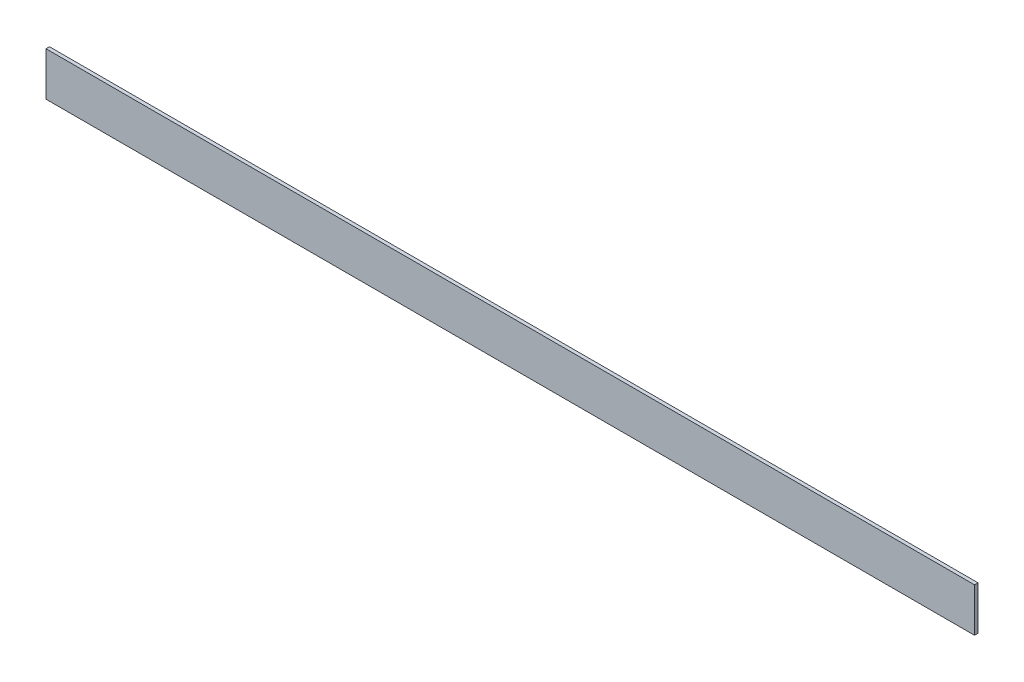
ISO-10303-21;
HEADER;
FILE_DESCRIPTION(('STEP AP214'),'2;1');
FILE_NAME('part.step','',(''),(''),'','','');
FILE_SCHEMA(('AUTOMOTIVE_DESIGN { 1 0 10303 214 1 1 1 1 }'));
ENDSEC;
DATA;
#1=APPLICATION_CONTEXT('core data for automotive mechanical design processes');
#2=APPLICATION_PROTOCOL_DEFINITION('international standard','automotive_design',2000,#1);
#3=PRODUCT_CONTEXT('',#1,'mechanical');
#4=PRODUCT('Part','Part','',(#3));
#5=PRODUCT_RELATED_PRODUCT_CATEGORY('part','',(#4));
#6=PRODUCT_DEFINITION_FORMATION('','',#4);
#7=PRODUCT_DEFINITION_CONTEXT('part definition',#1,'design');
#8=PRODUCT_DEFINITION('design','',#6,#7);
#9=PRODUCT_DEFINITION_SHAPE('','',#8);
#10=(LENGTH_UNIT() NAMED_UNIT(*) SI_UNIT(.MILLI.,.METRE.));
#11=(NAMED_UNIT(*) PLANE_ANGLE_UNIT() SI_UNIT($,.RADIAN.));
#12=(NAMED_UNIT(*) SI_UNIT($,.STERADIAN.) SOLID_ANGLE_UNIT());
#13=UNCERTAINTY_MEASURE_WITH_UNIT(LENGTH_MEASURE(1.E-05),#10,'distance_accuracy_value','');
#14=(GEOMETRIC_REPRESENTATION_CONTEXT(3) GLOBAL_UNCERTAINTY_ASSIGNED_CONTEXT((#13)) GLOBAL_UNIT_ASSIGNED_CONTEXT((#10,
#11,#12)) REPRESENTATION_CONTEXT('',''));
#15=CARTESIAN_POINT('',(0.,0.,0.));
#16=DIRECTION('',(0.,0.,1.));
#17=DIRECTION('',(1.,0.,0.));
#18=AXIS2_PLACEMENT_3D('',#15,#16,#17);
#19=CARTESIAN_POINT('',(531.,0.,0.));
#20=DIRECTION('',(0.,1.,0.));
#21=DIRECTION('',(0.,0.,1.));
#22=AXIS2_PLACEMENT_3D('',#19,#20,#21);
#23=PLANE('',#22);
#24=DIRECTION('',(0.,0.,-1.));
#25=VECTOR('',#24,1.);
#26=CARTESIAN_POINT('',(508.,0.,-2.));
#27=LINE('',#26,#25);
#28=CARTESIAN_POINT('',(508.,0.,-2.));
#29=VERTEX_POINT('',#28);
#30=CARTESIAN_POINT('',(508.,0.,-25.));
#31=VERTEX_POINT('',#30);
#32=EDGE_CURVE('E113',#29,#31,#27,.T.);
#33=ORIENTED_EDGE('',*,*,#32,.F.);
#34=DIRECTION('',(-1.,0.,0.));
#35=VECTOR('',#34,1.);
#36=CARTESIAN_POINT('',(531.,0.,-2.));
#37=LINE('',#36,#35);
#38=CARTESIAN_POINT('',(531.,0.,-2.));
#39=VERTEX_POINT('',#38);
#40=EDGE_CURVE('E121',#39,#29,#37,.T.);
#41=ORIENTED_EDGE('',*,*,#40,.F.);
#42=DIRECTION('',(0.,0.,-1.));
#43=VECTOR('',#42,1.);
#44=CARTESIAN_POINT('',(531.,0.,0.));
#45=LINE('',#44,#43);
#46=CARTESIAN_POINT('',(531.,0.,0.));
#47=VERTEX_POINT('',#46);
#48=EDGE_CURVE('E147',#47,#39,#45,.T.);
#49=ORIENTED_EDGE('',*,*,#48,.F.);
#50=DIRECTION('',(-1.,0.,0.));
#51=VECTOR('',#50,1.);
#52=CARTESIAN_POINT('',(531.,0.,0.));
#53=LINE('',#52,#51);
#54=CARTESIAN_POINT('',(0.,0.,0.));
#55=VERTEX_POINT('',#54);
#56=EDGE_CURVE('E154',#47,#55,#53,.T.);
#57=ORIENTED_EDGE('',*,*,#56,.T.);
#58=DIRECTION('',(0.,0.,-1.));
#59=VECTOR('',#58,1.);
#60=CARTESIAN_POINT('',(0.,0.,0.));
#61=LINE('',#60,#59);
#62=CARTESIAN_POINT('',(0.,0.,-2.));
#63=VERTEX_POINT('',#62);
#64=EDGE_CURVE('E146',#55,#63,#61,.T.);
#65=ORIENTED_EDGE('',*,*,#64,.T.);
#66=DIRECTION('',(-1.,0.,0.));
#67=VECTOR('',#66,1.);
#68=CARTESIAN_POINT('',(0.,0.,-2.));
#69=LINE('',#68,#67);
#70=CARTESIAN_POINT('',(23.,0.,-2.));
#71=VERTEX_POINT('',#70);
#72=EDGE_CURVE('E136',#71,#63,#69,.T.);
#73=ORIENTED_EDGE('',*,*,#72,.F.);
#74=DIRECTION('',(0.,0.,1.));
#75=VECTOR('',#74,1.);
#76=CARTESIAN_POINT('',(23.,0.,-2.));
#77=LINE('',#76,#75);
#78=CARTESIAN_POINT('',(23.,0.,-25.));
#79=VERTEX_POINT('',#78);
#80=EDGE_CURVE('E133',#79,#71,#77,.T.);
#81=ORIENTED_EDGE('',*,*,#80,.F.);
#82=DIRECTION('',(-1.,0.,0.));
#83=VECTOR('',#82,1.);
#84=CARTESIAN_POINT('',(531.,0.,-25.));
#85=LINE('',#84,#83);
#86=EDGE_CURVE('E11',#31,#79,#85,.T.);
#87=ORIENTED_EDGE('',*,*,#86,.F.);
#88=EDGE_LOOP('',(#33,#41,#49,#57,#65,#73,#81,#87));
#89=FACE_BOUND('',#88,.T.);
#90=ADVANCED_FACE('F36',(#89),#23,.F.);
#91=CARTESIAN_POINT('',(531.,2.,-25.));
#92=DIRECTION('',(0.,0.,-1.));
#93=DIRECTION('',(-1.,0.,0.));
#94=AXIS2_PLACEMENT_3D('',#91,#92,#93);
#95=PLANE('',#94);
#96=DIRECTION('',(0.,-1.,0.));
#97=VECTOR('',#96,1.);
#98=CARTESIAN_POINT('',(508.,25.,-25.));
#99=LINE('',#98,#97);
#100=CARTESIAN_POINT('',(508.,2.,-25.));
#101=VERTEX_POINT('',#100);
#102=EDGE_CURVE('E118',#101,#31,#99,.T.);
#103=ORIENTED_EDGE('',*,*,#102,.T.);
#104=ORIENTED_EDGE('',*,*,#86,.T.);
#105=DIRECTION('',(0.,-1.,0.));
#106=VECTOR('',#105,1.);
#107=CARTESIAN_POINT('',(23.,25.,-25.));
#108=LINE('',#107,#106);
#109=CARTESIAN_POINT('',(23.,2.,-25.));
#110=VERTEX_POINT('',#109);
#111=EDGE_CURVE('E138',#110,#79,#108,.T.);
#112=ORIENTED_EDGE('',*,*,#111,.F.);
#113=DIRECTION('',(-1.,0.,0.));
#114=VECTOR('',#113,1.);
#115=CARTESIAN_POINT('',(531.,2.,-25.));
#116=LINE('',#115,#114);
#117=EDGE_CURVE('E43',#101,#110,#116,.T.);
#118=ORIENTED_EDGE('',*,*,#117,.F.);
#119=EDGE_LOOP('',(#103,#104,#112,#118));
#120=FACE_BOUND('',#119,.T.);
#121=ADVANCED_FACE('F175',(#120),#95,.T.);
#122=CARTESIAN_POINT('',(531.,2.,0.));
#123=DIRECTION('',(0.,1.,0.));
#124=DIRECTION('',(0.,0.,1.));
#125=AXIS2_PLACEMENT_3D('',#122,#123,#124);
#126=PLANE('',#125);
#127=DIRECTION('',(0.,0.,1.));
#128=VECTOR('',#127,1.);
#129=CARTESIAN_POINT('',(508.,2.,0.));
#130=LINE('',#129,#128);
#131=CARTESIAN_POINT('',(508.,2.,-2.));
#132=VERTEX_POINT('',#131);
#133=EDGE_CURVE('E116',#101,#132,#130,.T.);
#134=ORIENTED_EDGE('',*,*,#133,.F.);
#135=ORIENTED_EDGE('',*,*,#117,.T.);
#136=DIRECTION('',(0.,0.,-1.));
#137=VECTOR('',#136,1.);
#138=CARTESIAN_POINT('',(23.,2.,0.));
#139=LINE('',#138,#137);
#140=CARTESIAN_POINT('',(23.,2.,-2.));
#141=VERTEX_POINT('',#140);
#142=EDGE_CURVE('E141',#141,#110,#139,.T.);
#143=ORIENTED_EDGE('',*,*,#142,.F.);
#144=DIRECTION('',(-1.,0.,0.));
#145=VECTOR('',#144,1.);
#146=CARTESIAN_POINT('',(531.,2.,-2.));
#147=LINE('',#146,#145);
#148=EDGE_CURVE('E165',#132,#141,#147,.T.);
#149=ORIENTED_EDGE('',*,*,#148,.F.);
#150=EDGE_LOOP('',(#134,#135,#143,#149));
#151=FACE_BOUND('',#150,.T.);
#152=ADVANCED_FACE('F169',(#151),#126,.T.);
#153=CARTESIAN_POINT('',(531.,25.,-2.));
#154=DIRECTION('',(0.,0.,-1.));
#155=DIRECTION('',(0.,1.,0.));
#156=AXIS2_PLACEMENT_3D('',#153,#154,#155);
#157=PLANE('',#156);
#158=DIRECTION('',(0.,-1.,0.));
#159=VECTOR('',#158,1.);
#160=CARTESIAN_POINT('',(0.,25.,-2.));
#161=LINE('',#160,#159);
#162=CARTESIAN_POINT('',(0.,25.,-2.));
#163=VERTEX_POINT('',#162);
#164=EDGE_CURVE('E50',#163,#63,#161,.T.);
#165=ORIENTED_EDGE('',*,*,#164,.F.);
#166=DIRECTION('',(-1.,0.,0.));
#167=VECTOR('',#166,1.);
#168=CARTESIAN_POINT('',(531.,25.,-2.));
#169=LINE('',#168,#167);
#170=CARTESIAN_POINT('',(531.,25.,-2.));
#171=VERTEX_POINT('',#170);
#172=EDGE_CURVE('E81',#171,#163,#169,.T.);
#173=ORIENTED_EDGE('',*,*,#172,.F.);
#174=DIRECTION('',(0.,-1.,0.));
#175=VECTOR('',#174,1.);
#176=CARTESIAN_POINT('',(531.,25.,-2.));
#177=LINE('',#176,#175);
#178=EDGE_CURVE('E123',#171,#39,#177,.T.);
#179=ORIENTED_EDGE('',*,*,#178,.T.);
#180=ORIENTED_EDGE('',*,*,#40,.T.);
#181=DIRECTION('',(0.,-1.,0.));
#182=VECTOR('',#181,1.);
#183=CARTESIAN_POINT('',(508.,25.,-2.));
#184=LINE('',#183,#182);
#185=EDGE_CURVE('E109',#132,#29,#184,.T.);
#186=ORIENTED_EDGE('',*,*,#185,.F.);
#187=ORIENTED_EDGE('',*,*,#148,.T.);
#188=DIRECTION('',(0.,-1.,0.));
#189=VECTOR('',#188,1.);
#190=CARTESIAN_POINT('',(23.,25.,-2.));
#191=LINE('',#190,#189);
#192=EDGE_CURVE('E139',#141,#71,#191,.T.);
#193=ORIENTED_EDGE('',*,*,#192,.T.);
#194=ORIENTED_EDGE('',*,*,#72,.T.);
#195=EDGE_LOOP('',(#165,#173,#179,#180,#186,#187,#193,#194));
#196=FACE_BOUND('',#195,.T.);
#197=ADVANCED_FACE('F122',(#196),#157,.T.);
#198=CARTESIAN_POINT('',(531.,25.,0.));
#199=DIRECTION('',(0.,1.,0.));
#200=DIRECTION('',(0.,0.,1.));
#201=AXIS2_PLACEMENT_3D('',#198,#199,#200);
#202=PLANE('',#201);
#203=DIRECTION('',(0.,0.,-1.));
#204=VECTOR('',#203,1.);
#205=CARTESIAN_POINT('',(0.,25.,0.));
#206=LINE('',#205,#204);
#207=CARTESIAN_POINT('',(0.,25.,0.));
#208=VERTEX_POINT('',#207);
#209=EDGE_CURVE('E158',#208,#163,#206,.T.);
#210=ORIENTED_EDGE('',*,*,#209,.F.);
#211=DIRECTION('',(-1.,0.,0.));
#212=VECTOR('',#211,1.);
#213=CARTESIAN_POINT('',(531.,25.,0.));
#214=LINE('',#213,#212);
#215=CARTESIAN_POINT('',(531.,25.,0.));
#216=VERTEX_POINT('',#215);
#217=EDGE_CURVE('E162',#216,#208,#214,.T.);
#218=ORIENTED_EDGE('',*,*,#217,.F.);
#219=DIRECTION('',(0.,0.,-1.));
#220=VECTOR('',#219,1.);
#221=CARTESIAN_POINT('',(531.,25.,0.));
#222=LINE('',#221,#220);
#223=EDGE_CURVE('E150',#216,#171,#222,.T.);
#224=ORIENTED_EDGE('',*,*,#223,.T.);
#225=ORIENTED_EDGE('',*,*,#172,.T.);
#226=EDGE_LOOP('',(#210,#218,#224,#225));
#227=FACE_BOUND('',#226,.T.);
#228=ADVANCED_FACE('F185',(#227),#202,.T.);
#229=CARTESIAN_POINT('',(531.,25.,0.));
#230=DIRECTION('',(0.,0.,-1.));
#231=DIRECTION('',(0.,1.,0.));
#232=AXIS2_PLACEMENT_3D('',#229,#230,#231);
#233=PLANE('',#232);
#234=DIRECTION('',(0.,-1.,0.));
#235=VECTOR('',#234,1.);
#236=CARTESIAN_POINT('',(0.,25.,0.));
#237=LINE('',#236,#235);
#238=EDGE_CURVE('E76',#208,#55,#237,.T.);
#239=ORIENTED_EDGE('',*,*,#238,.T.);
#240=ORIENTED_EDGE('',*,*,#56,.F.);
#241=DIRECTION('',(0.,-1.,0.));
#242=VECTOR('',#241,1.);
#243=CARTESIAN_POINT('',(531.,25.,0.));
#244=LINE('',#243,#242);
#245=EDGE_CURVE('E59',#216,#47,#244,.T.);
#246=ORIENTED_EDGE('',*,*,#245,.F.);
#247=ORIENTED_EDGE('',*,*,#217,.T.);
#248=EDGE_LOOP('',(#239,#240,#246,#247));
#249=FACE_BOUND('',#248,.T.);
#250=ADVANCED_FACE('F188',(#249),#233,.F.);
#251=CARTESIAN_POINT('',(531.,0.,0.));
#252=DIRECTION('',(-1.,0.,0.));
#253=DIRECTION('',(0.,0.,1.));
#254=AXIS2_PLACEMENT_3D('',#251,#252,#253);
#255=PLANE('',#254);
#256=ORIENTED_EDGE('',*,*,#48,.T.);
#257=ORIENTED_EDGE('',*,*,#178,.F.);
#258=ORIENTED_EDGE('',*,*,#223,.F.);
#259=ORIENTED_EDGE('',*,*,#245,.T.);
#260=EDGE_LOOP('',(#256,#257,#258,#259));
#261=FACE_BOUND('',#260,.T.);
#262=ADVANCED_FACE('F192',(#261),#255,.F.);
#263=CARTESIAN_POINT('',(0.,0.,0.));
#264=DIRECTION('',(-1.,0.,0.));
#265=DIRECTION('',(0.,0.,1.));
#266=AXIS2_PLACEMENT_3D('',#263,#264,#265);
#267=PLANE('',#266);
#268=ORIENTED_EDGE('',*,*,#164,.T.);
#269=ORIENTED_EDGE('',*,*,#64,.F.);
#270=ORIENTED_EDGE('',*,*,#238,.F.);
#271=ORIENTED_EDGE('',*,*,#209,.T.);
#272=EDGE_LOOP('',(#268,#269,#270,#271));
#273=FACE_BOUND('',#272,.T.);
#274=ADVANCED_FACE('F193',(#273),#267,.T.);
#275=CARTESIAN_POINT('',(23.,25.,-2.));
#276=DIRECTION('',(1.,0.,0.));
#277=DIRECTION('',(0.,0.,-1.));
#278=AXIS2_PLACEMENT_3D('',#275,#276,#277);
#279=PLANE('',#278);
#280=ORIENTED_EDGE('',*,*,#142,.T.);
#281=ORIENTED_EDGE('',*,*,#111,.T.);
#282=ORIENTED_EDGE('',*,*,#80,.T.);
#283=ORIENTED_EDGE('',*,*,#192,.F.);
#284=EDGE_LOOP('',(#280,#281,#282,#283));
#285=FACE_BOUND('',#284,.T.);
#286=ADVANCED_FACE('F174',(#285),#279,.F.);
#287=CARTESIAN_POINT('',(508.,25.,-2.));
#288=DIRECTION('',(-1.,0.,0.));
#289=DIRECTION('',(0.,0.,1.));
#290=AXIS2_PLACEMENT_3D('',#287,#288,#289);
#291=PLANE('',#290);
#292=ORIENTED_EDGE('',*,*,#133,.T.);
#293=ORIENTED_EDGE('',*,*,#185,.T.);
#294=ORIENTED_EDGE('',*,*,#32,.T.);
#295=ORIENTED_EDGE('',*,*,#102,.F.);
#296=EDGE_LOOP('',(#292,#293,#294,#295));
#297=FACE_BOUND('',#296,.T.);
#298=ADVANCED_FACE('F111',(#297),#291,.F.);
#299=CLOSED_SHELL('',(#90,#121,#152,#197,#228,#250,#262,#274,#286,#298));
#300=MANIFOLD_SOLID_BREP('B2',#299);
#301=ADVANCED_BREP_SHAPE_REPRESENTATION('',(#18,#300),#14);
#302=SHAPE_DEFINITION_REPRESENTATION(#9,#301);
ENDSEC;
END-ISO-10303-21;
